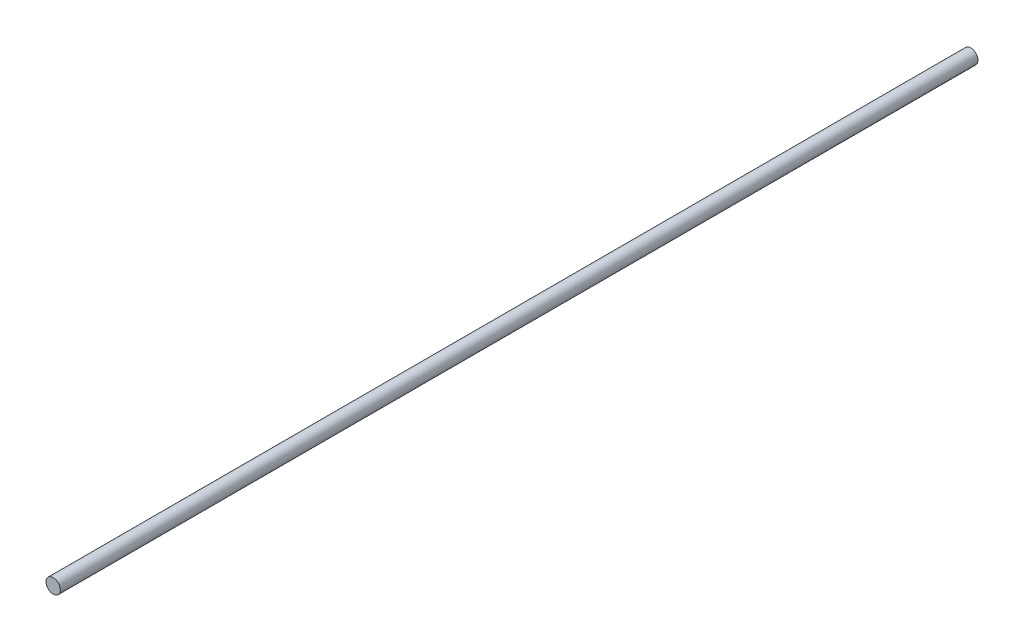
ISO-10303-21;
HEADER;
FILE_DESCRIPTION(('STEP AP214'),'2;1');
FILE_NAME('part.step','',(''),(''),'','','');
FILE_SCHEMA(('AUTOMOTIVE_DESIGN { 1 0 10303 214 1 1 1 1 }'));
ENDSEC;
DATA;
#1=APPLICATION_CONTEXT('core data for automotive mechanical design processes');
#2=APPLICATION_PROTOCOL_DEFINITION('international standard','automotive_design',2000,#1);
#3=PRODUCT_CONTEXT('',#1,'mechanical');
#4=PRODUCT('Part','Part','',(#3));
#5=PRODUCT_RELATED_PRODUCT_CATEGORY('part','',(#4));
#6=PRODUCT_DEFINITION_FORMATION('','',#4);
#7=PRODUCT_DEFINITION_CONTEXT('part definition',#1,'design');
#8=PRODUCT_DEFINITION('design','',#6,#7);
#9=PRODUCT_DEFINITION_SHAPE('','',#8);
#10=(LENGTH_UNIT() NAMED_UNIT(*) SI_UNIT(.MILLI.,.METRE.));
#11=(NAMED_UNIT(*) PLANE_ANGLE_UNIT() SI_UNIT($,.RADIAN.));
#12=(NAMED_UNIT(*) SI_UNIT($,.STERADIAN.) SOLID_ANGLE_UNIT());
#13=UNCERTAINTY_MEASURE_WITH_UNIT(LENGTH_MEASURE(1.E-05),#10,'distance_accuracy_value','');
#14=(GEOMETRIC_REPRESENTATION_CONTEXT(3) GLOBAL_UNCERTAINTY_ASSIGNED_CONTEXT((#13)) GLOBAL_UNIT_ASSIGNED_CONTEXT((#10,
#11,#12)) REPRESENTATION_CONTEXT('',''));
#15=CARTESIAN_POINT('',(0.,0.,0.));
#16=DIRECTION('',(0.,0.,1.));
#17=DIRECTION('',(1.,0.,0.));
#18=AXIS2_PLACEMENT_3D('',#15,#16,#17);
#19=CARTESIAN_POINT('',(-18.0817607368501,12.1069184528726,0.));
#20=DIRECTION('',(0.,0.,-1.));
#21=DIRECTION('',(-1.,0.,0.));
#22=AXIS2_PLACEMENT_3D('',#19,#20,#21);
#23=PLANE('',#22);
#24=CARTESIAN_POINT('',(-18.0817607368501,12.1069184528726,0.));
#25=DIRECTION('',(0.,0.,1.));
#26=DIRECTION('',(1.,0.,0.));
#27=AXIS2_PLACEMENT_3D('',#24,#25,#26);
#28=CIRCLE('',#27,3.175);
#29=CARTESIAN_POINT('',(-14.9067607368501,12.1069184528726,0.));
#30=VERTEX_POINT('',#29);
#31=EDGE_CURVE('E18',#30,#30,#28,.T.);
#32=ORIENTED_EDGE('',*,*,#31,.F.);
#33=EDGE_LOOP('',(#32));
#34=FACE_BOUND('',#33,.T.);
#35=ADVANCED_FACE('F15',(#34),#23,.T.);
#36=CARTESIAN_POINT('',(-18.0817607368501,12.1069184528726,406.4));
#37=DIRECTION('',(0.,0.,-1.));
#38=DIRECTION('',(-1.,0.,0.));
#39=AXIS2_PLACEMENT_3D('',#36,#37,#38);
#40=PLANE('',#39);
#41=CARTESIAN_POINT('',(-18.0817607368501,12.1069184528726,406.4));
#42=DIRECTION('',(0.,0.,1.));
#43=DIRECTION('',(1.,0.,0.));
#44=AXIS2_PLACEMENT_3D('',#41,#42,#43);
#45=CIRCLE('',#44,3.175);
#46=CARTESIAN_POINT('',(-14.9067607368501,12.1069184528726,406.4));
#47=VERTEX_POINT('',#46);
#48=EDGE_CURVE('E10',#47,#47,#45,.F.);
#49=ORIENTED_EDGE('',*,*,#48,.F.);
#50=EDGE_LOOP('',(#49));
#51=FACE_BOUND('',#50,.T.);
#52=ADVANCED_FACE('F30',(#51),#40,.F.);
#53=CARTESIAN_POINT('',(-18.0817607368501,12.1069184528726,0.));
#54=DIRECTION('',(0.,0.,1.));
#55=DIRECTION('',(1.,0.,0.));
#56=AXIS2_PLACEMENT_3D('',#53,#54,#55);
#57=CYLINDRICAL_SURFACE('',#56,3.175);
#58=ORIENTED_EDGE('',*,*,#48,.T.);
#59=EDGE_LOOP('',(#58));
#60=FACE_BOUND('',#59,.T.);
#61=ORIENTED_EDGE('',*,*,#31,.T.);
#62=EDGE_LOOP('',(#61));
#63=FACE_BOUND('',#62,.T.);
#64=ADVANCED_FACE('F27',(#60,#63),#57,.T.);
#65=CLOSED_SHELL('',(#35,#52,#64));
#66=MANIFOLD_SOLID_BREP('B1',#65);
#67=ADVANCED_BREP_SHAPE_REPRESENTATION('',(#18,#66),#14);
#68=SHAPE_DEFINITION_REPRESENTATION(#9,#67);
ENDSEC;
END-ISO-10303-21;
